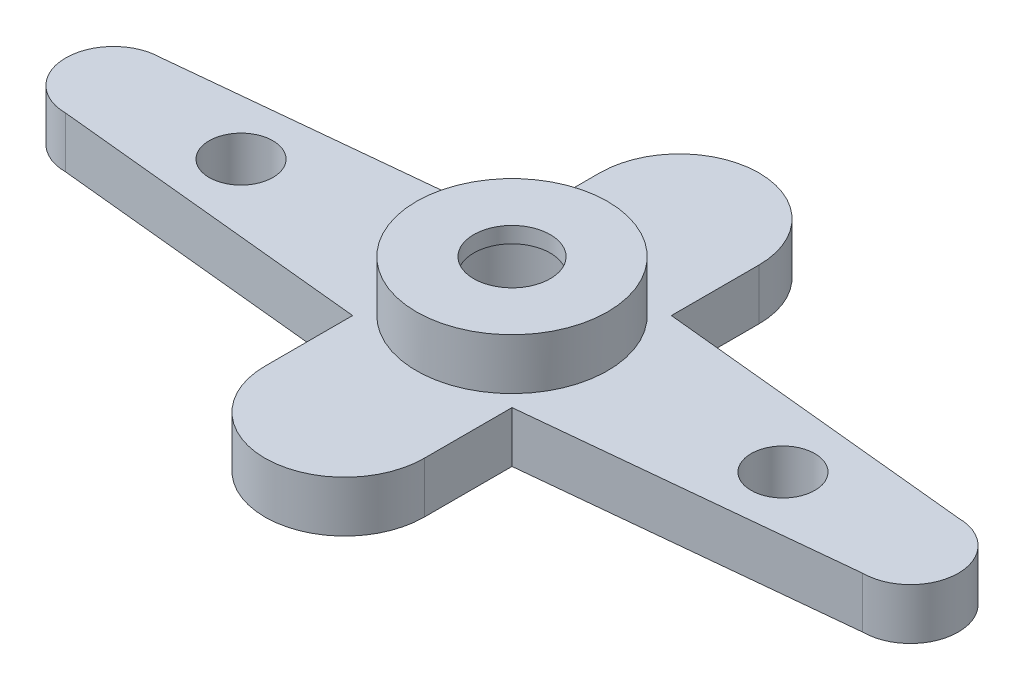
ISO-10303-21;
HEADER;
FILE_DESCRIPTION(('STEP AP214'),'2;1');
FILE_NAME('part.step','',(''),(''),'','','');
FILE_SCHEMA(('AUTOMOTIVE_DESIGN { 1 0 10303 214 1 1 1 1 }'));
ENDSEC;
DATA;
#1=APPLICATION_CONTEXT('core data for automotive mechanical design processes');
#2=APPLICATION_PROTOCOL_DEFINITION('international standard','automotive_design',2000,#1);
#3=PRODUCT_CONTEXT('',#1,'mechanical');
#4=PRODUCT('Part','Part','',(#3));
#5=PRODUCT_RELATED_PRODUCT_CATEGORY('part','',(#4));
#6=PRODUCT_DEFINITION_FORMATION('','',#4);
#7=PRODUCT_DEFINITION_CONTEXT('part definition',#1,'design');
#8=PRODUCT_DEFINITION('design','',#6,#7);
#9=PRODUCT_DEFINITION_SHAPE('','',#8);
#10=(LENGTH_UNIT() NAMED_UNIT(*) SI_UNIT(.MILLI.,.METRE.));
#11=(NAMED_UNIT(*) PLANE_ANGLE_UNIT() SI_UNIT($,.RADIAN.));
#12=(NAMED_UNIT(*) SI_UNIT($,.STERADIAN.) SOLID_ANGLE_UNIT());
#13=UNCERTAINTY_MEASURE_WITH_UNIT(LENGTH_MEASURE(1.E-05),#10,'distance_accuracy_value','');
#14=(GEOMETRIC_REPRESENTATION_CONTEXT(3) GLOBAL_UNCERTAINTY_ASSIGNED_CONTEXT((#13)) GLOBAL_UNIT_ASSIGNED_CONTEXT((#10,
#11,#12)) REPRESENTATION_CONTEXT('',''));
#15=CARTESIAN_POINT('',(0.,0.,0.));
#16=DIRECTION('',(0.,0.,1.));
#17=DIRECTION('',(1.,0.,0.));
#18=AXIS2_PLACEMENT_3D('',#15,#16,#17);
#19=CARTESIAN_POINT('',(0.,4.,0.));
#20=DIRECTION('',(0.,-1.,0.));
#21=DIRECTION('',(0.,0.,-1.));
#22=AXIS2_PLACEMENT_3D('',#19,#20,#21);
#23=CYLINDRICAL_SURFACE('',#22,10.);
#24=CARTESIAN_POINT('',(0.,-4.,0.));
#25=DIRECTION('',(0.,1.,0.));
#26=DIRECTION('',(0.,0.,1.));
#27=AXIS2_PLACEMENT_3D('',#24,#25,#26);
#28=CIRCLE('',#27,10.);
#29=CARTESIAN_POINT('',(0.,-4.,10.));
#30=VERTEX_POINT('',#29);
#31=EDGE_CURVE('E161',#30,#30,#28,.T.);
#32=ORIENTED_EDGE('',*,*,#31,.F.);
#33=EDGE_LOOP('',(#32));
#34=FACE_BOUND('',#33,.T.);
#35=CARTESIAN_POINT('',(0.,9.5,0.));
#36=DIRECTION('',(0.,1.,0.));
#37=DIRECTION('',(0.,0.,1.));
#38=AXIS2_PLACEMENT_3D('',#35,#36,#37);
#39=CIRCLE('',#38,10.);
#40=CARTESIAN_POINT('',(0.,9.5,10.));
#41=VERTEX_POINT('',#40);
#42=EDGE_CURVE('E457',#41,#41,#39,.T.);
#43=ORIENTED_EDGE('',*,*,#42,.T.);
#44=EDGE_LOOP('',(#43));
#45=FACE_BOUND('',#44,.T.);
#46=ADVANCED_FACE('F34',(#34,#45),#23,.F.);
#47=CARTESIAN_POINT('',(62.5,4.,0.));
#48=DIRECTION('',(0.,-1.,0.));
#49=DIRECTION('',(0.,0.,-1.));
#50=AXIS2_PLACEMENT_3D('',#47,#48,#49);
#51=PLANE('',#50);
#52=CARTESIAN_POINT('',(42.5,4.,0.));
#53=DIRECTION('',(0.,1.,0.));
#54=DIRECTION('',(0.,0.,1.));
#55=AXIS2_PLACEMENT_3D('',#52,#53,#54);
#56=CIRCLE('',#55,5.);
#57=CARTESIAN_POINT('',(42.5,4.,4.99999999999999));
#58=VERTEX_POINT('',#57);
#59=EDGE_CURVE('E467',#58,#58,#56,.T.);
#60=ORIENTED_EDGE('',*,*,#59,.F.);
#61=EDGE_LOOP('',(#60));
#62=FACE_BOUND('',#61,.T.);
#63=CARTESIAN_POINT('',(-42.5,4.,0.));
#64=DIRECTION('',(0.,1.,0.));
#65=DIRECTION('',(0.,0.,1.));
#66=AXIS2_PLACEMENT_3D('',#63,#64,#65);
#67=CIRCLE('',#66,5.);
#68=CARTESIAN_POINT('',(-42.5,4.,5.));
#69=VERTEX_POINT('',#68);
#70=EDGE_CURVE('E462',#69,#69,#67,.T.);
#71=ORIENTED_EDGE('',*,*,#70,.F.);
#72=EDGE_LOOP('',(#71));
#73=FACE_BOUND('',#72,.T.);
#74=DIRECTION('',(-0.995037190209989,0.,-0.099503719020999));
#75=VECTOR('',#74,1.);
#76=CARTESIAN_POINT('',(12.5,4.,-12.5));
#77=LINE('',#76,#75);
#78=CARTESIAN_POINT('',(62.5,4.,-7.5));
#79=VERTEX_POINT('',#78);
#80=CARTESIAN_POINT('',(12.5,4.,-12.5));
#81=VERTEX_POINT('',#80);
#82=EDGE_CURVE('E180',#79,#81,#77,.T.);
#83=ORIENTED_EDGE('',*,*,#82,.T.);
#84=DIRECTION('',(0.,0.,-1.));
#85=VECTOR('',#84,1.);
#86=CARTESIAN_POINT('',(12.5,4.,-12.5));
#87=LINE('',#86,#85);
#88=CARTESIAN_POINT('',(12.5,4.,-26.25));
#89=VERTEX_POINT('',#88);
#90=EDGE_CURVE('E107',#81,#89,#87,.T.);
#91=ORIENTED_EDGE('',*,*,#90,.T.);
#92=CARTESIAN_POINT('',(0.,4.,-26.25));
#93=DIRECTION('',(0.,1.,0.));
#94=DIRECTION('',(0.,0.,1.));
#95=AXIS2_PLACEMENT_3D('',#92,#93,#94);
#96=CIRCLE('',#95,12.5);
#97=CARTESIAN_POINT('',(-12.5,4.,-26.25));
#98=VERTEX_POINT('',#97);
#99=EDGE_CURVE('E226',#89,#98,#96,.T.);
#100=ORIENTED_EDGE('',*,*,#99,.T.);
#101=DIRECTION('',(0.,0.,1.));
#102=VECTOR('',#101,1.);
#103=CARTESIAN_POINT('',(-12.5,4.,-26.25));
#104=LINE('',#103,#102);
#105=CARTESIAN_POINT('',(-12.5,4.,-12.5));
#106=VERTEX_POINT('',#105);
#107=EDGE_CURVE('E223',#98,#106,#104,.T.);
#108=ORIENTED_EDGE('',*,*,#107,.T.);
#109=DIRECTION('',(-0.995037190209989,0.,0.099503719020999));
#110=VECTOR('',#109,1.);
#111=CARTESIAN_POINT('',(-12.5,4.,-12.5));
#112=LINE('',#111,#110);
#113=CARTESIAN_POINT('',(-62.5,4.,-7.5));
#114=VERTEX_POINT('',#113);
#115=EDGE_CURVE('E225',#106,#114,#112,.T.);
#116=ORIENTED_EDGE('',*,*,#115,.T.);
#117=CARTESIAN_POINT('',(-62.5,4.,0.));
#118=DIRECTION('',(0.,1.,0.));
#119=DIRECTION('',(0.,0.,-1.));
#120=AXIS2_PLACEMENT_3D('',#117,#118,#119);
#121=CIRCLE('',#120,7.5);
#122=CARTESIAN_POINT('',(-62.5,4.,7.5));
#123=VERTEX_POINT('',#122);
#124=EDGE_CURVE('E228',#114,#123,#121,.T.);
#125=ORIENTED_EDGE('',*,*,#124,.T.);
#126=DIRECTION('',(0.995037190209989,0.,0.099503719020999));
#127=VECTOR('',#126,1.);
#128=CARTESIAN_POINT('',(-62.5,4.,7.5));
#129=LINE('',#128,#127);
#130=CARTESIAN_POINT('',(-12.5,4.,12.5));
#131=VERTEX_POINT('',#130);
#132=EDGE_CURVE('E234',#123,#131,#129,.T.);
#133=ORIENTED_EDGE('',*,*,#132,.T.);
#134=DIRECTION('',(0.,0.,1.));
#135=VECTOR('',#134,1.);
#136=CARTESIAN_POINT('',(-12.5,4.,26.25));
#137=LINE('',#136,#135);
#138=CARTESIAN_POINT('',(-12.5,4.,26.25));
#139=VERTEX_POINT('',#138);
#140=EDGE_CURVE('E236',#131,#139,#137,.T.);
#141=ORIENTED_EDGE('',*,*,#140,.T.);
#142=CARTESIAN_POINT('',(0.,4.,26.25));
#143=DIRECTION('',(0.,1.,0.));
#144=DIRECTION('',(0.,0.,1.));
#145=AXIS2_PLACEMENT_3D('',#142,#143,#144);
#146=CIRCLE('',#145,12.5);
#147=CARTESIAN_POINT('',(12.5,4.,26.25));
#148=VERTEX_POINT('',#147);
#149=EDGE_CURVE('E139',#139,#148,#146,.T.);
#150=ORIENTED_EDGE('',*,*,#149,.T.);
#151=DIRECTION('',(0.,0.,-1.));
#152=VECTOR('',#151,1.);
#153=CARTESIAN_POINT('',(12.5,4.,12.5));
#154=LINE('',#153,#152);
#155=CARTESIAN_POINT('',(12.5,4.,12.5));
#156=VERTEX_POINT('',#155);
#157=EDGE_CURVE('E132',#148,#156,#154,.T.);
#158=ORIENTED_EDGE('',*,*,#157,.T.);
#159=DIRECTION('',(0.995037190209989,0.,-0.099503719020999));
#160=VECTOR('',#159,1.);
#161=CARTESIAN_POINT('',(62.5,4.,7.5));
#162=LINE('',#161,#160);
#163=CARTESIAN_POINT('',(62.5,4.,7.5));
#164=VERTEX_POINT('',#163);
#165=EDGE_CURVE('E137',#156,#164,#162,.T.);
#166=ORIENTED_EDGE('',*,*,#165,.T.);
#167=CARTESIAN_POINT('',(62.5,4.,0.));
#168=DIRECTION('',(0.,1.,0.));
#169=DIRECTION('',(0.,0.,-1.));
#170=AXIS2_PLACEMENT_3D('',#167,#168,#169);
#171=CIRCLE('',#170,7.5);
#172=EDGE_CURVE('E51',#164,#79,#171,.T.);
#173=ORIENTED_EDGE('',*,*,#172,.T.);
#174=EDGE_LOOP('',(#83,#91,#100,#108,#116,#125,#133,#141,#150,#158,#166,#173));
#175=FACE_BOUND('',#174,.T.);
#176=CARTESIAN_POINT('',(0.,4.,0.));
#177=DIRECTION('',(0.,-1.,0.));
#178=DIRECTION('',(0.,0.,-1.));
#179=AXIS2_PLACEMENT_3D('',#176,#177,#178);
#180=CIRCLE('',#179,15.);
#181=CARTESIAN_POINT('',(0.,4.,-15.));
#182=VERTEX_POINT('',#181);
#183=EDGE_CURVE('E11',#182,#182,#180,.F.);
#184=ORIENTED_EDGE('',*,*,#183,.F.);
#185=EDGE_LOOP('',(#184));
#186=FACE_BOUND('',#185,.T.);
#187=ADVANCED_FACE('F134',(#62,#73,#175,#186),#51,.F.);
#188=CARTESIAN_POINT('',(62.5,-4.,0.));
#189=DIRECTION('',(0.,-1.,0.));
#190=DIRECTION('',(0.,0.,-1.));
#191=AXIS2_PLACEMENT_3D('',#188,#189,#190);
#192=PLANE('',#191);
#193=CARTESIAN_POINT('',(42.5,-4.,0.));
#194=DIRECTION('',(0.,1.,0.));
#195=DIRECTION('',(0.,0.,1.));
#196=AXIS2_PLACEMENT_3D('',#193,#194,#195);
#197=CIRCLE('',#196,5.);
#198=CARTESIAN_POINT('',(42.5,-4.,4.99999999999999));
#199=VERTEX_POINT('',#198);
#200=EDGE_CURVE('E463',#199,#199,#197,.T.);
#201=ORIENTED_EDGE('',*,*,#200,.T.);
#202=EDGE_LOOP('',(#201));
#203=FACE_BOUND('',#202,.T.);
#204=CARTESIAN_POINT('',(-42.5,-4.,0.));
#205=DIRECTION('',(0.,1.,0.));
#206=DIRECTION('',(0.,0.,1.));
#207=AXIS2_PLACEMENT_3D('',#204,#205,#206);
#208=CIRCLE('',#207,5.);
#209=CARTESIAN_POINT('',(-42.5,-4.,5.));
#210=VERTEX_POINT('',#209);
#211=EDGE_CURVE('E470',#210,#210,#208,.T.);
#212=ORIENTED_EDGE('',*,*,#211,.T.);
#213=EDGE_LOOP('',(#212));
#214=FACE_BOUND('',#213,.T.);
#215=DIRECTION('',(-0.995037190209989,0.,-0.099503719020999));
#216=VECTOR('',#215,1.);
#217=CARTESIAN_POINT('',(12.5,-4.,-12.5));
#218=LINE('',#217,#216);
#219=CARTESIAN_POINT('',(62.5,-4.,-7.5));
#220=VERTEX_POINT('',#219);
#221=CARTESIAN_POINT('',(12.5,-4.,-12.5));
#222=VERTEX_POINT('',#221);
#223=EDGE_CURVE('E157',#220,#222,#218,.T.);
#224=ORIENTED_EDGE('',*,*,#223,.F.);
#225=CARTESIAN_POINT('',(62.5,-4.,0.));
#226=DIRECTION('',(0.,1.,0.));
#227=DIRECTION('',(0.,0.,-1.));
#228=AXIS2_PLACEMENT_3D('',#225,#226,#227);
#229=CIRCLE('',#228,7.5);
#230=CARTESIAN_POINT('',(62.5,-4.,7.5));
#231=VERTEX_POINT('',#230);
#232=EDGE_CURVE('E98',#231,#220,#229,.T.);
#233=ORIENTED_EDGE('',*,*,#232,.F.);
#234=DIRECTION('',(0.995037190209989,0.,-0.099503719020999));
#235=VECTOR('',#234,1.);
#236=CARTESIAN_POINT('',(62.5,-4.,7.5));
#237=LINE('',#236,#235);
#238=CARTESIAN_POINT('',(12.5,-4.,12.5));
#239=VERTEX_POINT('',#238);
#240=EDGE_CURVE('E92',#239,#231,#237,.T.);
#241=ORIENTED_EDGE('',*,*,#240,.F.);
#242=DIRECTION('',(0.,0.,-1.));
#243=VECTOR('',#242,1.);
#244=CARTESIAN_POINT('',(12.5,-4.,12.5));
#245=LINE('',#244,#243);
#246=CARTESIAN_POINT('',(12.5,-4.,26.25));
#247=VERTEX_POINT('',#246);
#248=EDGE_CURVE('E147',#247,#239,#245,.T.);
#249=ORIENTED_EDGE('',*,*,#248,.F.);
#250=CARTESIAN_POINT('',(0.,-4.,26.25));
#251=DIRECTION('',(0.,1.,0.));
#252=DIRECTION('',(0.,0.,1.));
#253=AXIS2_PLACEMENT_3D('',#250,#251,#252);
#254=CIRCLE('',#253,12.5);
#255=CARTESIAN_POINT('',(-12.5,-4.,26.25));
#256=VERTEX_POINT('',#255);
#257=EDGE_CURVE('E175',#256,#247,#254,.T.);
#258=ORIENTED_EDGE('',*,*,#257,.F.);
#259=DIRECTION('',(0.,0.,1.));
#260=VECTOR('',#259,1.);
#261=CARTESIAN_POINT('',(-12.5,-4.,26.25));
#262=LINE('',#261,#260);
#263=CARTESIAN_POINT('',(-12.5,-4.,12.5));
#264=VERTEX_POINT('',#263);
#265=EDGE_CURVE('E173',#264,#256,#262,.T.);
#266=ORIENTED_EDGE('',*,*,#265,.F.);
#267=DIRECTION('',(0.995037190209989,0.,0.099503719020999));
#268=VECTOR('',#267,1.);
#269=CARTESIAN_POINT('',(-62.5,-4.,7.5));
#270=LINE('',#269,#268);
#271=CARTESIAN_POINT('',(-62.5,-4.,7.5));
#272=VERTEX_POINT('',#271);
#273=EDGE_CURVE('E171',#272,#264,#270,.T.);
#274=ORIENTED_EDGE('',*,*,#273,.F.);
#275=CARTESIAN_POINT('',(-62.5,-4.,0.));
#276=DIRECTION('',(0.,1.,0.));
#277=DIRECTION('',(0.,0.,-1.));
#278=AXIS2_PLACEMENT_3D('',#275,#276,#277);
#279=CIRCLE('',#278,7.5);
#280=CARTESIAN_POINT('',(-62.5,-4.,-7.5));
#281=VERTEX_POINT('',#280);
#282=EDGE_CURVE('E169',#281,#272,#279,.T.);
#283=ORIENTED_EDGE('',*,*,#282,.F.);
#284=DIRECTION('',(-0.995037190209989,0.,0.099503719020999));
#285=VECTOR('',#284,1.);
#286=CARTESIAN_POINT('',(-12.5,-4.,-12.5));
#287=LINE('',#286,#285);
#288=CARTESIAN_POINT('',(-12.5,-4.,-12.5));
#289=VERTEX_POINT('',#288);
#290=EDGE_CURVE('E167',#289,#281,#287,.T.);
#291=ORIENTED_EDGE('',*,*,#290,.F.);
#292=DIRECTION('',(0.,0.,1.));
#293=VECTOR('',#292,1.);
#294=CARTESIAN_POINT('',(-12.5,-4.,-26.25));
#295=LINE('',#294,#293);
#296=CARTESIAN_POINT('',(-12.5,-4.,-26.25));
#297=VERTEX_POINT('',#296);
#298=EDGE_CURVE('E165',#297,#289,#295,.T.);
#299=ORIENTED_EDGE('',*,*,#298,.F.);
#300=CARTESIAN_POINT('',(0.,-4.,-26.25));
#301=DIRECTION('',(0.,1.,0.));
#302=DIRECTION('',(0.,0.,1.));
#303=AXIS2_PLACEMENT_3D('',#300,#301,#302);
#304=CIRCLE('',#303,12.5);
#305=CARTESIAN_POINT('',(12.5,-4.,-26.25));
#306=VERTEX_POINT('',#305);
#307=EDGE_CURVE('E163',#306,#297,#304,.T.);
#308=ORIENTED_EDGE('',*,*,#307,.F.);
#309=DIRECTION('',(0.,0.,-1.));
#310=VECTOR('',#309,1.);
#311=CARTESIAN_POINT('',(12.5,-4.,-12.5));
#312=LINE('',#311,#310);
#313=EDGE_CURVE('E160',#222,#306,#312,.T.);
#314=ORIENTED_EDGE('',*,*,#313,.F.);
#315=EDGE_LOOP('',(#224,#233,#241,#249,#258,#266,#274,#283,#291,#299,#308,#314));
#316=FACE_BOUND('',#315,.T.);
#317=ORIENTED_EDGE('',*,*,#31,.T.);
#318=EDGE_LOOP('',(#317));
#319=FACE_BOUND('',#318,.T.);
#320=ADVANCED_FACE('F210',(#203,#214,#316,#319),#192,.T.);
#321=CARTESIAN_POINT('',(12.5,4.,-12.5));
#322=DIRECTION('',(-0.099503719020999,0.,0.995037190209989));
#323=DIRECTION('',(0.995037190209989,0.,0.0995037190209991));
#324=AXIS2_PLACEMENT_3D('',#321,#322,#323);
#325=PLANE('',#324);
#326=ORIENTED_EDGE('',*,*,#223,.T.);
#327=DIRECTION('',(0.,-1.,0.));
#328=VECTOR('',#327,1.);
#329=CARTESIAN_POINT('',(12.5,4.,-12.5));
#330=LINE('',#329,#328);
#331=EDGE_CURVE('E43',#81,#222,#330,.T.);
#332=ORIENTED_EDGE('',*,*,#331,.F.);
#333=ORIENTED_EDGE('',*,*,#82,.F.);
#334=DIRECTION('',(0.,-1.,0.));
#335=VECTOR('',#334,1.);
#336=CARTESIAN_POINT('',(62.5,4.,-7.5));
#337=LINE('',#336,#335);
#338=EDGE_CURVE('E153',#79,#220,#337,.T.);
#339=ORIENTED_EDGE('',*,*,#338,.T.);
#340=EDGE_LOOP('',(#326,#332,#333,#339));
#341=FACE_BOUND('',#340,.T.);
#342=ADVANCED_FACE('F36',(#341),#325,.F.);
#343=CARTESIAN_POINT('',(12.5,4.,-12.5));
#344=DIRECTION('',(-1.,0.,0.));
#345=DIRECTION('',(0.,0.,1.));
#346=AXIS2_PLACEMENT_3D('',#343,#344,#345);
#347=PLANE('',#346);
#348=ORIENTED_EDGE('',*,*,#313,.T.);
#349=DIRECTION('',(0.,-1.,0.));
#350=VECTOR('',#349,1.);
#351=CARTESIAN_POINT('',(12.5,4.,-26.25));
#352=LINE('',#351,#350);
#353=EDGE_CURVE('E202',#89,#306,#352,.T.);
#354=ORIENTED_EDGE('',*,*,#353,.F.);
#355=ORIENTED_EDGE('',*,*,#90,.F.);
#356=ORIENTED_EDGE('',*,*,#331,.T.);
#357=EDGE_LOOP('',(#348,#354,#355,#356));
#358=FACE_BOUND('',#357,.T.);
#359=ADVANCED_FACE('F205',(#358),#347,.F.);
#360=CARTESIAN_POINT('',(0.,4.,-26.25));
#361=DIRECTION('',(0.,-1.,0.));
#362=DIRECTION('',(0.,0.,-1.));
#363=AXIS2_PLACEMENT_3D('',#360,#361,#362);
#364=CYLINDRICAL_SURFACE('',#363,12.5);
#365=ORIENTED_EDGE('',*,*,#307,.T.);
#366=DIRECTION('',(0.,-1.,0.));
#367=VECTOR('',#366,1.);
#368=CARTESIAN_POINT('',(-12.5,4.,-26.25));
#369=LINE('',#368,#367);
#370=EDGE_CURVE('E199',#98,#297,#369,.T.);
#371=ORIENTED_EDGE('',*,*,#370,.F.);
#372=ORIENTED_EDGE('',*,*,#99,.F.);
#373=ORIENTED_EDGE('',*,*,#353,.T.);
#374=EDGE_LOOP('',(#365,#371,#372,#373));
#375=FACE_BOUND('',#374,.T.);
#376=ADVANCED_FACE('F217',(#375),#364,.T.);
#377=CARTESIAN_POINT('',(-12.5,4.,-26.25));
#378=DIRECTION('',(1.,0.,0.));
#379=DIRECTION('',(0.,0.,-1.));
#380=AXIS2_PLACEMENT_3D('',#377,#378,#379);
#381=PLANE('',#380);
#382=ORIENTED_EDGE('',*,*,#298,.T.);
#383=DIRECTION('',(0.,-1.,0.));
#384=VECTOR('',#383,1.);
#385=CARTESIAN_POINT('',(-12.5,4.,-12.5));
#386=LINE('',#385,#384);
#387=EDGE_CURVE('E196',#106,#289,#386,.T.);
#388=ORIENTED_EDGE('',*,*,#387,.F.);
#389=ORIENTED_EDGE('',*,*,#107,.F.);
#390=ORIENTED_EDGE('',*,*,#370,.T.);
#391=EDGE_LOOP('',(#382,#388,#389,#390));
#392=FACE_BOUND('',#391,.T.);
#393=ADVANCED_FACE('F221',(#392),#381,.F.);
#394=CARTESIAN_POINT('',(-12.5,4.,-12.5));
#395=DIRECTION('',(0.099503719020999,0.,0.995037190209989));
#396=DIRECTION('',(0.995037190209989,0.,-0.099503719020999));
#397=AXIS2_PLACEMENT_3D('',#394,#395,#396);
#398=PLANE('',#397);
#399=ORIENTED_EDGE('',*,*,#290,.T.);
#400=DIRECTION('',(0.,-1.,0.));
#401=VECTOR('',#400,1.);
#402=CARTESIAN_POINT('',(-62.5,4.,-7.5));
#403=LINE('',#402,#401);
#404=EDGE_CURVE('E193',#114,#281,#403,.T.);
#405=ORIENTED_EDGE('',*,*,#404,.F.);
#406=ORIENTED_EDGE('',*,*,#115,.F.);
#407=ORIENTED_EDGE('',*,*,#387,.T.);
#408=EDGE_LOOP('',(#399,#405,#406,#407));
#409=FACE_BOUND('',#408,.T.);
#410=ADVANCED_FACE('F257',(#409),#398,.F.);
#411=CARTESIAN_POINT('',(-62.5,4.,0.));
#412=DIRECTION('',(0.,-1.,0.));
#413=DIRECTION('',(0.,0.,-1.));
#414=AXIS2_PLACEMENT_3D('',#411,#412,#413);
#415=CYLINDRICAL_SURFACE('',#414,7.5);
#416=ORIENTED_EDGE('',*,*,#282,.T.);
#417=DIRECTION('',(0.,-1.,0.));
#418=VECTOR('',#417,1.);
#419=CARTESIAN_POINT('',(-62.5,4.,7.5));
#420=LINE('',#419,#418);
#421=EDGE_CURVE('E190',#123,#272,#420,.T.);
#422=ORIENTED_EDGE('',*,*,#421,.F.);
#423=ORIENTED_EDGE('',*,*,#124,.F.);
#424=ORIENTED_EDGE('',*,*,#404,.T.);
#425=EDGE_LOOP('',(#416,#422,#423,#424));
#426=FACE_BOUND('',#425,.T.);
#427=ADVANCED_FACE('F254',(#426),#415,.T.);
#428=CARTESIAN_POINT('',(-62.5,4.,7.5));
#429=DIRECTION('',(0.099503719020999,0.,-0.995037190209989));
#430=DIRECTION('',(-0.995037190209989,0.,-0.099503719020999));
#431=AXIS2_PLACEMENT_3D('',#428,#429,#430);
#432=PLANE('',#431);
#433=ORIENTED_EDGE('',*,*,#273,.T.);
#434=DIRECTION('',(0.,-1.,0.));
#435=VECTOR('',#434,1.);
#436=CARTESIAN_POINT('',(-12.5,4.,12.5));
#437=LINE('',#436,#435);
#438=EDGE_CURVE('E187',#131,#264,#437,.T.);
#439=ORIENTED_EDGE('',*,*,#438,.F.);
#440=ORIENTED_EDGE('',*,*,#132,.F.);
#441=ORIENTED_EDGE('',*,*,#421,.T.);
#442=EDGE_LOOP('',(#433,#439,#440,#441));
#443=FACE_BOUND('',#442,.T.);
#444=ADVANCED_FACE('F250',(#443),#432,.F.);
#445=CARTESIAN_POINT('',(-12.5,4.,26.25));
#446=DIRECTION('',(1.,0.,0.));
#447=DIRECTION('',(0.,0.,-1.));
#448=AXIS2_PLACEMENT_3D('',#445,#446,#447);
#449=PLANE('',#448);
#450=ORIENTED_EDGE('',*,*,#265,.T.);
#451=DIRECTION('',(0.,-1.,0.));
#452=VECTOR('',#451,1.);
#453=CARTESIAN_POINT('',(-12.5,4.,26.25));
#454=LINE('',#453,#452);
#455=EDGE_CURVE('E184',#139,#256,#454,.T.);
#456=ORIENTED_EDGE('',*,*,#455,.F.);
#457=ORIENTED_EDGE('',*,*,#140,.F.);
#458=ORIENTED_EDGE('',*,*,#438,.T.);
#459=EDGE_LOOP('',(#450,#456,#457,#458));
#460=FACE_BOUND('',#459,.T.);
#461=ADVANCED_FACE('F242',(#460),#449,.F.);
#462=CARTESIAN_POINT('',(0.,4.,26.25));
#463=DIRECTION('',(0.,-1.,0.));
#464=DIRECTION('',(0.,0.,-1.));
#465=AXIS2_PLACEMENT_3D('',#462,#463,#464);
#466=CYLINDRICAL_SURFACE('',#465,12.5);
#467=ORIENTED_EDGE('',*,*,#257,.T.);
#468=DIRECTION('',(0.,-1.,0.));
#469=VECTOR('',#468,1.);
#470=CARTESIAN_POINT('',(12.5,4.,26.25));
#471=LINE('',#470,#469);
#472=EDGE_CURVE('E148',#148,#247,#471,.T.);
#473=ORIENTED_EDGE('',*,*,#472,.F.);
#474=ORIENTED_EDGE('',*,*,#149,.F.);
#475=ORIENTED_EDGE('',*,*,#455,.T.);
#476=EDGE_LOOP('',(#467,#473,#474,#475));
#477=FACE_BOUND('',#476,.T.);
#478=ADVANCED_FACE('F246',(#477),#466,.T.);
#479=CARTESIAN_POINT('',(12.5,4.,12.5));
#480=DIRECTION('',(-1.,0.,0.));
#481=DIRECTION('',(0.,0.,1.));
#482=AXIS2_PLACEMENT_3D('',#479,#480,#481);
#483=PLANE('',#482);
#484=ORIENTED_EDGE('',*,*,#248,.T.);
#485=DIRECTION('',(0.,-1.,0.));
#486=VECTOR('',#485,1.);
#487=CARTESIAN_POINT('',(12.5,4.,12.5));
#488=LINE('',#487,#486);
#489=EDGE_CURVE('E144',#156,#239,#488,.T.);
#490=ORIENTED_EDGE('',*,*,#489,.F.);
#491=ORIENTED_EDGE('',*,*,#157,.F.);
#492=ORIENTED_EDGE('',*,*,#472,.T.);
#493=EDGE_LOOP('',(#484,#490,#491,#492));
#494=FACE_BOUND('',#493,.T.);
#495=ADVANCED_FACE('F145',(#494),#483,.F.);
#496=CARTESIAN_POINT('',(62.5,4.,7.5));
#497=DIRECTION('',(-0.099503719020999,0.,-0.995037190209989));
#498=DIRECTION('',(-0.995037190209989,0.,0.099503719020999));
#499=AXIS2_PLACEMENT_3D('',#496,#497,#498);
#500=PLANE('',#499);
#501=ORIENTED_EDGE('',*,*,#240,.T.);
#502=DIRECTION('',(0.,-1.,0.));
#503=VECTOR('',#502,1.);
#504=CARTESIAN_POINT('',(62.5,4.,7.5));
#505=LINE('',#504,#503);
#506=EDGE_CURVE('E149',#164,#231,#505,.T.);
#507=ORIENTED_EDGE('',*,*,#506,.F.);
#508=ORIENTED_EDGE('',*,*,#165,.F.);
#509=ORIENTED_EDGE('',*,*,#489,.T.);
#510=EDGE_LOOP('',(#501,#507,#508,#509));
#511=FACE_BOUND('',#510,.T.);
#512=ADVANCED_FACE('F151',(#511),#500,.F.);
#513=CARTESIAN_POINT('',(62.5,4.,0.));
#514=DIRECTION('',(0.,-1.,0.));
#515=DIRECTION('',(0.,0.,-1.));
#516=AXIS2_PLACEMENT_3D('',#513,#514,#515);
#517=CYLINDRICAL_SURFACE('',#516,7.5);
#518=ORIENTED_EDGE('',*,*,#232,.T.);
#519=ORIENTED_EDGE('',*,*,#338,.F.);
#520=ORIENTED_EDGE('',*,*,#172,.F.);
#521=ORIENTED_EDGE('',*,*,#506,.T.);
#522=EDGE_LOOP('',(#518,#519,#520,#521));
#523=FACE_BOUND('',#522,.T.);
#524=ADVANCED_FACE('F283',(#523),#517,.T.);
#525=CARTESIAN_POINT('',(0.,12.,0.));
#526=DIRECTION('',(0.,1.,0.));
#527=DIRECTION('',(0.,0.,1.));
#528=AXIS2_PLACEMENT_3D('',#525,#526,#527);
#529=PLANE('',#528);
#530=CARTESIAN_POINT('',(0.,12.,0.));
#531=DIRECTION('',(0.,1.,0.));
#532=DIRECTION('',(0.,0.,1.));
#533=AXIS2_PLACEMENT_3D('',#530,#531,#532);
#534=CIRCLE('',#533,15.);
#535=CARTESIAN_POINT('',(0.,12.,15.));
#536=VERTEX_POINT('',#535);
#537=EDGE_CURVE('E466',#536,#536,#534,.T.);
#538=ORIENTED_EDGE('',*,*,#537,.T.);
#539=EDGE_LOOP('',(#538));
#540=FACE_BOUND('',#539,.T.);
#541=CARTESIAN_POINT('',(0.,12.,0.));
#542=DIRECTION('',(0.,1.,0.));
#543=DIRECTION('',(0.,0.,1.));
#544=AXIS2_PLACEMENT_3D('',#541,#542,#543);
#545=CIRCLE('',#544,6.);
#546=CARTESIAN_POINT('',(0.,12.,6.));
#547=VERTEX_POINT('',#546);
#548=EDGE_CURVE('E451',#547,#547,#545,.T.);
#549=ORIENTED_EDGE('',*,*,#548,.F.);
#550=EDGE_LOOP('',(#549));
#551=FACE_BOUND('',#550,.T.);
#552=ADVANCED_FACE('F286',(#540,#551),#529,.T.);
#553=CARTESIAN_POINT('',(0.,12.,0.));
#554=DIRECTION('',(0.,-1.,0.));
#555=DIRECTION('',(0.,0.,-1.));
#556=AXIS2_PLACEMENT_3D('',#553,#554,#555);
#557=CYLINDRICAL_SURFACE('',#556,15.);
#558=ORIENTED_EDGE('',*,*,#537,.F.);
#559=EDGE_LOOP('',(#558));
#560=FACE_BOUND('',#559,.T.);
#561=ORIENTED_EDGE('',*,*,#183,.T.);
#562=EDGE_LOOP('',(#561));
#563=FACE_BOUND('',#562,.T.);
#564=ADVANCED_FACE('F277',(#560,#563),#557,.T.);
#565=CARTESIAN_POINT('',(-42.5,-4.,0.));
#566=DIRECTION('',(0.,1.,0.));
#567=DIRECTION('',(0.,0.,1.));
#568=AXIS2_PLACEMENT_3D('',#565,#566,#567);
#569=CYLINDRICAL_SURFACE('',#568,5.);
#570=ORIENTED_EDGE('',*,*,#211,.F.);
#571=EDGE_LOOP('',(#570));
#572=FACE_BOUND('',#571,.T.);
#573=ORIENTED_EDGE('',*,*,#70,.T.);
#574=EDGE_LOOP('',(#573));
#575=FACE_BOUND('',#574,.T.);
#576=ADVANCED_FACE('F333',(#572,#575),#569,.F.);
#577=CARTESIAN_POINT('',(42.5,-4.,0.));
#578=DIRECTION('',(0.,1.,0.));
#579=DIRECTION('',(0.,0.,1.));
#580=AXIS2_PLACEMENT_3D('',#577,#578,#579);
#581=CYLINDRICAL_SURFACE('',#580,5.);
#582=ORIENTED_EDGE('',*,*,#200,.F.);
#583=EDGE_LOOP('',(#582));
#584=FACE_BOUND('',#583,.T.);
#585=ORIENTED_EDGE('',*,*,#59,.T.);
#586=EDGE_LOOP('',(#585));
#587=FACE_BOUND('',#586,.T.);
#588=ADVANCED_FACE('F341',(#584,#587),#581,.F.);
#589=CARTESIAN_POINT('',(0.,9.5,0.));
#590=DIRECTION('',(0.,1.,0.));
#591=DIRECTION('',(0.,0.,1.));
#592=AXIS2_PLACEMENT_3D('',#589,#590,#591);
#593=PLANE('',#592);
#594=ORIENTED_EDGE('',*,*,#42,.F.);
#595=EDGE_LOOP('',(#594));
#596=FACE_BOUND('',#595,.T.);
#597=CARTESIAN_POINT('',(0.,9.5,0.));
#598=DIRECTION('',(0.,1.,0.));
#599=DIRECTION('',(0.,0.,1.));
#600=AXIS2_PLACEMENT_3D('',#597,#598,#599);
#601=CIRCLE('',#600,6.);
#602=CARTESIAN_POINT('',(0.,9.5,6.));
#603=VERTEX_POINT('',#602);
#604=EDGE_CURVE('E454',#603,#603,#601,.T.);
#605=ORIENTED_EDGE('',*,*,#604,.T.);
#606=EDGE_LOOP('',(#605));
#607=FACE_BOUND('',#606,.T.);
#608=ADVANCED_FACE('F350',(#596,#607),#593,.F.);
#609=CARTESIAN_POINT('',(0.,12.,0.));
#610=DIRECTION('',(0.,-1.,0.));
#611=DIRECTION('',(0.,0.,-1.));
#612=AXIS2_PLACEMENT_3D('',#609,#610,#611);
#613=CYLINDRICAL_SURFACE('',#612,6.);
#614=ORIENTED_EDGE('',*,*,#548,.T.);
#615=EDGE_LOOP('',(#614));
#616=FACE_BOUND('',#615,.T.);
#617=ORIENTED_EDGE('',*,*,#604,.F.);
#618=EDGE_LOOP('',(#617));
#619=FACE_BOUND('',#618,.T.);
#620=ADVANCED_FACE('F357',(#616,#619),#613,.F.);
#621=CLOSED_SHELL('',(#46,#187,#320,#342,#359,#376,#393,#410,#427,#444,#461,#478,#495,#512,#524,
#552,#564,#576,#588,#608,#620));
#622=MANIFOLD_SOLID_BREP('B2',#621);
#623=ADVANCED_BREP_SHAPE_REPRESENTATION('',(#18,#622),#14);
#624=SHAPE_DEFINITION_REPRESENTATION(#9,#623);
ENDSEC;
END-ISO-10303-21;
